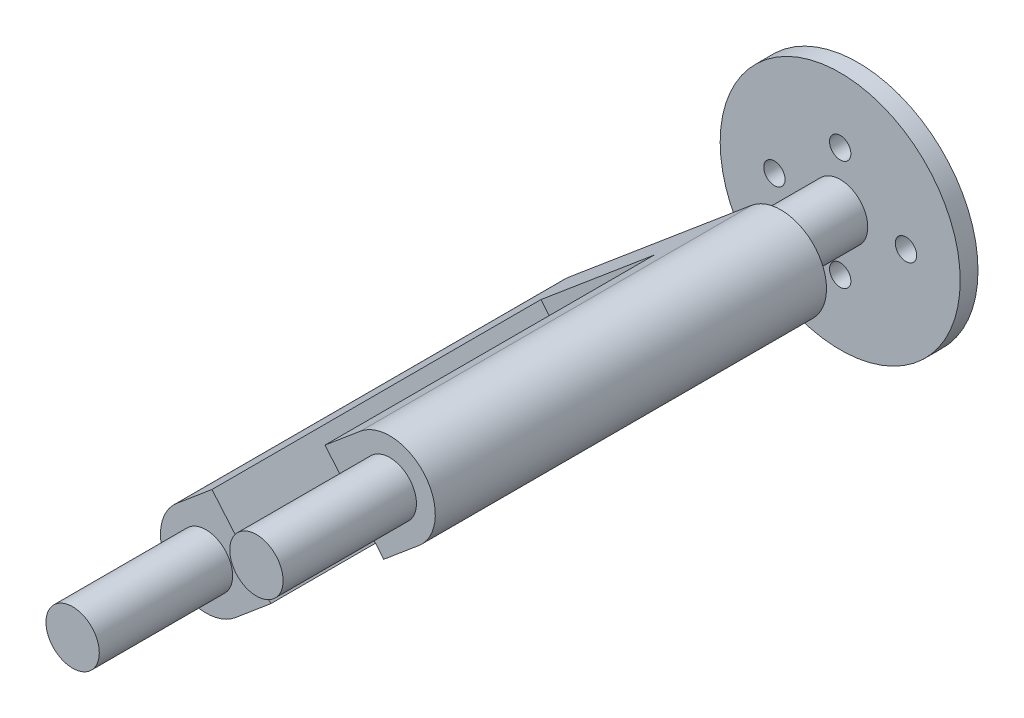
ISO-10303-21;
HEADER;
FILE_DESCRIPTION(('STEP AP214'),'2;1');
FILE_NAME('part.step','',(''),(''),'','','');
FILE_SCHEMA(('AUTOMOTIVE_DESIGN { 1 0 10303 214 1 1 1 1 }'));
ENDSEC;
DATA;
#1=APPLICATION_CONTEXT('core data for automotive mechanical design processes');
#2=APPLICATION_PROTOCOL_DEFINITION('international standard','automotive_design',2000,#1);
#3=PRODUCT_CONTEXT('',#1,'mechanical');
#4=PRODUCT('Part','Part','',(#3));
#5=PRODUCT_RELATED_PRODUCT_CATEGORY('part','',(#4));
#6=PRODUCT_DEFINITION_FORMATION('','',#4);
#7=PRODUCT_DEFINITION_CONTEXT('part definition',#1,'design');
#8=PRODUCT_DEFINITION('design','',#6,#7);
#9=PRODUCT_DEFINITION_SHAPE('','',#8);
#10=(LENGTH_UNIT() NAMED_UNIT(*) SI_UNIT(.MILLI.,.METRE.));
#11=(NAMED_UNIT(*) PLANE_ANGLE_UNIT() SI_UNIT($,.RADIAN.));
#12=(NAMED_UNIT(*) SI_UNIT($,.STERADIAN.) SOLID_ANGLE_UNIT());
#13=UNCERTAINTY_MEASURE_WITH_UNIT(LENGTH_MEASURE(1.E-05),#10,'distance_accuracy_value','');
#14=(GEOMETRIC_REPRESENTATION_CONTEXT(3) GLOBAL_UNCERTAINTY_ASSIGNED_CONTEXT((#13)) GLOBAL_UNIT_ASSIGNED_CONTEXT((#10,
#11,#12)) REPRESENTATION_CONTEXT('',''));
#15=CARTESIAN_POINT('',(0.,0.,0.));
#16=DIRECTION('',(0.,0.,1.));
#17=DIRECTION('',(1.,0.,0.));
#18=AXIS2_PLACEMENT_3D('',#15,#16,#17);
#19=CARTESIAN_POINT('',(13.1266768569368,11.0291150911376,80.01));
#20=DIRECTION('',(0.,0.,1.));
#21=DIRECTION('',(1.,0.,0.));
#22=AXIS2_PLACEMENT_3D('',#19,#20,#21);
#23=PLANE('',#22);
#24=DIRECTION('',(-0.645630982646055,0.763649549366389,0.));
#25=VECTOR('',#24,1.);
#26=CARTESIAN_POINT('',(8.08359687434195,6.76542019676247,80.01));
#27=LINE('',#26,#25);
#28=CARTESIAN_POINT('',(12.2694152674727,1.81445220488687,80.01));
#29=VERTEX_POINT('',#28);
#30=CARTESIAN_POINT('',(3.87161152714887,11.747338349357,80.01));
#31=VERTEX_POINT('',#30);
#32=EDGE_CURVE('E110',#29,#31,#27,.T.);
#33=ORIENTED_EDGE('',*,*,#32,.F.);
#34=DIRECTION('',(0.765627113265488,0.643284636403478,0.));
#35=VECTOR('',#34,1.);
#36=CARTESIAN_POINT('',(17.3102994193315,6.04983425000535,80.01));
#37=LINE('',#36,#35);
#38=CARTESIAN_POINT('',(17.3102994193315,6.04983425000535,80.01));
#39=VERTEX_POINT('',#38);
#40=EDGE_CURVE('E128',#29,#39,#37,.T.);
#41=ORIENTED_EDGE('',*,*,#40,.T.);
#42=CARTESIAN_POINT('',(13.1266768569368,11.0291150911376,80.01));
#43=DIRECTION('',(0.,0.,1.));
#44=DIRECTION('',(1.,0.,0.));
#45=AXIS2_PLACEMENT_3D('',#42,#43,#44);
#46=CIRCLE('',#45,6.5035325354337);
#47=CARTESIAN_POINT('',(8.94305429454215,16.0083959322699,80.01));
#48=VERTEX_POINT('',#47);
#49=EDGE_CURVE('E419',#39,#48,#46,.T.);
#50=ORIENTED_EDGE('',*,*,#49,.T.);
#51=DIRECTION('',(-0.765627113265488,-0.643284636403478,0.));
#52=VECTOR('',#51,1.);
#53=CARTESIAN_POINT('',(8.94305429454215,16.0083959322699,80.01));
#54=LINE('',#53,#52);
#55=EDGE_CURVE('E429',#48,#31,#54,.T.);
#56=ORIENTED_EDGE('',*,*,#55,.T.);
#57=EDGE_LOOP('',(#33,#41,#50,#56));
#58=FACE_BOUND('',#57,.T.);
#59=CARTESIAN_POINT('',(13.1266768569368,11.0291150911376,80.01));
#60=DIRECTION('',(0.,0.,1.));
#61=DIRECTION('',(1.,0.,0.));
#62=AXIS2_PLACEMENT_3D('',#59,#60,#61);
#63=CIRCLE('',#62,3.81);
#64=CARTESIAN_POINT('',(16.9366768569368,11.0291150911376,80.01));
#65=VERTEX_POINT('',#64);
#66=EDGE_CURVE('E111',#65,#65,#63,.T.);
#67=ORIENTED_EDGE('',*,*,#66,.F.);
#68=EDGE_LOOP('',(#67));
#69=FACE_BOUND('',#68,.T.);
#70=ADVANCED_FACE('F37',(#58,#69),#23,.T.);
#71=CARTESIAN_POINT('',(0.,0.,0.));
#72=DIRECTION('',(0.,0.,1.));
#73=DIRECTION('',(1.,0.,0.));
#74=AXIS2_PLACEMENT_3D('',#71,#72,#73);
#75=CYLINDRICAL_SURFACE('',#74,3.937);
#76=CARTESIAN_POINT('',(0.,0.,21.59));
#77=DIRECTION('',(0.,0.,1.));
#78=DIRECTION('',(1.,0.,0.));
#79=AXIS2_PLACEMENT_3D('',#76,#77,#78);
#80=CIRCLE('',#79,3.937);
#81=CARTESIAN_POINT('',(3.937,0.,21.59));
#82=VERTEX_POINT('',#81);
#83=EDGE_CURVE('E45',#82,#82,#80,.F.);
#84=ORIENTED_EDGE('',*,*,#83,.T.);
#85=EDGE_LOOP('',(#84));
#86=FACE_BOUND('',#85,.T.);
#87=CARTESIAN_POINT('',(0.,0.,2.54));
#88=DIRECTION('',(0.,0.,1.));
#89=DIRECTION('',(1.,0.,0.));
#90=AXIS2_PLACEMENT_3D('',#87,#88,#89);
#91=CIRCLE('',#90,3.937);
#92=CARTESIAN_POINT('',(3.937,0.,2.54));
#93=VERTEX_POINT('',#92);
#94=EDGE_CURVE('E173',#93,#93,#91,.T.);
#95=ORIENTED_EDGE('',*,*,#94,.T.);
#96=EDGE_LOOP('',(#95));
#97=FACE_BOUND('',#96,.T.);
#98=ADVANCED_FACE('F191',(#86,#97),#75,.T.);
#99=CARTESIAN_POINT('',(0.,0.,2.54));
#100=DIRECTION('',(0.,0.,1.));
#101=DIRECTION('',(1.,0.,0.));
#102=AXIS2_PLACEMENT_3D('',#99,#100,#101);
#103=PLANE('',#102);
#104=CARTESIAN_POINT('',(-3.06917882681312E-13,-7.87400000000045,2.54));
#105=DIRECTION('',(0.,0.,1.));
#106=DIRECTION('',(1.,0.,0.));
#107=AXIS2_PLACEMENT_3D('',#104,#105,#106);
#108=CIRCLE('',#107,1.52399999999963);
#109=CARTESIAN_POINT('',(1.52399999999932,-7.87400000000045,2.54));
#110=VERTEX_POINT('',#109);
#111=EDGE_CURVE('E158',#110,#110,#108,.T.);
#112=ORIENTED_EDGE('',*,*,#111,.F.);
#113=EDGE_LOOP('',(#112));
#114=FACE_BOUND('',#113,.T.);
#115=CARTESIAN_POINT('',(0.,7.874,2.54));
#116=DIRECTION('',(0.,0.,1.));
#117=DIRECTION('',(1.,0.,0.));
#118=AXIS2_PLACEMENT_3D('',#115,#116,#117);
#119=CIRCLE('',#118,1.524);
#120=CARTESIAN_POINT('',(1.524,7.874,2.54));
#121=VERTEX_POINT('',#120);
#122=EDGE_CURVE('E170',#121,#121,#119,.T.);
#123=ORIENTED_EDGE('',*,*,#122,.F.);
#124=EDGE_LOOP('',(#123));
#125=FACE_BOUND('',#124,.T.);
#126=CARTESIAN_POINT('',(0.,0.,2.54));
#127=DIRECTION('',(0.,0.,1.));
#128=DIRECTION('',(1.,0.,0.));
#129=AXIS2_PLACEMENT_3D('',#126,#127,#128);
#130=CIRCLE('',#129,17.145);
#131=CARTESIAN_POINT('',(17.145,0.,2.54));
#132=VERTEX_POINT('',#131);
#133=EDGE_CURVE('E179',#132,#132,#130,.T.);
#134=ORIENTED_EDGE('',*,*,#133,.T.);
#135=EDGE_LOOP('',(#134));
#136=FACE_BOUND('',#135,.T.);
#137=ORIENTED_EDGE('',*,*,#94,.F.);
#138=EDGE_LOOP('',(#137));
#139=FACE_BOUND('',#138,.T.);
#140=CARTESIAN_POINT('',(-9.398,0.,2.54));
#141=DIRECTION('',(0.,0.,1.));
#142=DIRECTION('',(1.,0.,0.));
#143=AXIS2_PLACEMENT_3D('',#140,#141,#142);
#144=CIRCLE('',#143,1.524);
#145=CARTESIAN_POINT('',(-7.874,0.,2.54));
#146=VERTEX_POINT('',#145);
#147=EDGE_CURVE('E164',#146,#146,#144,.T.);
#148=ORIENTED_EDGE('',*,*,#147,.F.);
#149=EDGE_LOOP('',(#148));
#150=FACE_BOUND('',#149,.T.);
#151=CARTESIAN_POINT('',(9.398,0.,2.54));
#152=DIRECTION('',(0.,0.,1.));
#153=DIRECTION('',(1.,0.,0.));
#154=AXIS2_PLACEMENT_3D('',#151,#152,#153);
#155=CIRCLE('',#154,1.524);
#156=CARTESIAN_POINT('',(10.922,0.,2.54));
#157=VERTEX_POINT('',#156);
#158=EDGE_CURVE('E152',#157,#157,#155,.T.);
#159=ORIENTED_EDGE('',*,*,#158,.F.);
#160=EDGE_LOOP('',(#159));
#161=FACE_BOUND('',#160,.T.);
#162=ADVANCED_FACE('F209',(#114,#125,#136,#139,#150,#161),#103,.T.);
#163=CARTESIAN_POINT('',(0.,0.,0.));
#164=DIRECTION('',(0.,0.,1.));
#165=DIRECTION('',(1.,0.,0.));
#166=AXIS2_PLACEMENT_3D('',#163,#164,#165);
#167=PLANE('',#166);
#168=CARTESIAN_POINT('',(0.,0.,0.));
#169=DIRECTION('',(0.,0.,1.));
#170=DIRECTION('',(1.,0.,0.));
#171=AXIS2_PLACEMENT_3D('',#168,#169,#170);
#172=CIRCLE('',#171,17.145);
#173=CARTESIAN_POINT('',(17.145,0.,0.));
#174=VERTEX_POINT('',#173);
#175=EDGE_CURVE('E178',#174,#174,#172,.T.);
#176=ORIENTED_EDGE('',*,*,#175,.F.);
#177=EDGE_LOOP('',(#176));
#178=FACE_BOUND('',#177,.T.);
#179=CARTESIAN_POINT('',(0.,7.874,0.));
#180=DIRECTION('',(0.,0.,1.));
#181=DIRECTION('',(1.,0.,0.));
#182=AXIS2_PLACEMENT_3D('',#179,#180,#181);
#183=CIRCLE('',#182,1.524);
#184=CARTESIAN_POINT('',(1.524,7.874,0.));
#185=VERTEX_POINT('',#184);
#186=EDGE_CURVE('E167',#185,#185,#183,.T.);
#187=ORIENTED_EDGE('',*,*,#186,.T.);
#188=EDGE_LOOP('',(#187));
#189=FACE_BOUND('',#188,.T.);
#190=CARTESIAN_POINT('',(-9.398,0.,0.));
#191=DIRECTION('',(0.,0.,1.));
#192=DIRECTION('',(1.,0.,0.));
#193=AXIS2_PLACEMENT_3D('',#190,#191,#192);
#194=CIRCLE('',#193,1.524);
#195=CARTESIAN_POINT('',(-7.874,0.,0.));
#196=VERTEX_POINT('',#195);
#197=EDGE_CURVE('E161',#196,#196,#194,.T.);
#198=ORIENTED_EDGE('',*,*,#197,.T.);
#199=EDGE_LOOP('',(#198));
#200=FACE_BOUND('',#199,.T.);
#201=CARTESIAN_POINT('',(-3.06917882681312E-13,-7.87400000000045,0.));
#202=DIRECTION('',(0.,0.,1.));
#203=DIRECTION('',(1.,0.,0.));
#204=AXIS2_PLACEMENT_3D('',#201,#202,#203);
#205=CIRCLE('',#204,1.52399999999963);
#206=CARTESIAN_POINT('',(1.52399999999932,-7.87400000000045,0.));
#207=VERTEX_POINT('',#206);
#208=EDGE_CURVE('E155',#207,#207,#205,.T.);
#209=ORIENTED_EDGE('',*,*,#208,.T.);
#210=EDGE_LOOP('',(#209));
#211=FACE_BOUND('',#210,.T.);
#212=CARTESIAN_POINT('',(9.398,0.,0.));
#213=DIRECTION('',(0.,0.,1.));
#214=DIRECTION('',(1.,0.,0.));
#215=AXIS2_PLACEMENT_3D('',#212,#213,#214);
#216=CIRCLE('',#215,1.524);
#217=CARTESIAN_POINT('',(10.922,0.,0.));
#218=VERTEX_POINT('',#217);
#219=EDGE_CURVE('E145',#218,#218,#216,.T.);
#220=ORIENTED_EDGE('',*,*,#219,.T.);
#221=EDGE_LOOP('',(#220));
#222=FACE_BOUND('',#221,.T.);
#223=ADVANCED_FACE('F261',(#178,#189,#200,#211,#222),#167,.F.);
#224=CARTESIAN_POINT('',(0.,0.,2.54));
#225=DIRECTION('',(0.,0.,-1.));
#226=DIRECTION('',(-1.,0.,0.));
#227=AXIS2_PLACEMENT_3D('',#224,#225,#226);
#228=CYLINDRICAL_SURFACE('',#227,17.145);
#229=ORIENTED_EDGE('',*,*,#133,.F.);
#230=EDGE_LOOP('',(#229));
#231=FACE_BOUND('',#230,.T.);
#232=ORIENTED_EDGE('',*,*,#175,.T.);
#233=EDGE_LOOP('',(#232));
#234=FACE_BOUND('',#233,.T.);
#235=ADVANCED_FACE('F257',(#231,#234),#228,.T.);
#236=CARTESIAN_POINT('',(0.,7.874,2.54));
#237=DIRECTION('',(0.,0.,-1.));
#238=DIRECTION('',(-1.,0.,0.));
#239=AXIS2_PLACEMENT_3D('',#236,#237,#238);
#240=CYLINDRICAL_SURFACE('',#239,1.524);
#241=ORIENTED_EDGE('',*,*,#122,.T.);
#242=EDGE_LOOP('',(#241));
#243=FACE_BOUND('',#242,.T.);
#244=ORIENTED_EDGE('',*,*,#186,.F.);
#245=EDGE_LOOP('',(#244));
#246=FACE_BOUND('',#245,.T.);
#247=ADVANCED_FACE('F253',(#243,#246),#240,.F.);
#248=CARTESIAN_POINT('',(-9.398,0.,2.54));
#249=DIRECTION('',(0.,0.,-1.));
#250=DIRECTION('',(-1.,0.,0.));
#251=AXIS2_PLACEMENT_3D('',#248,#249,#250);
#252=CYLINDRICAL_SURFACE('',#251,1.524);
#253=ORIENTED_EDGE('',*,*,#147,.T.);
#254=EDGE_LOOP('',(#253));
#255=FACE_BOUND('',#254,.T.);
#256=ORIENTED_EDGE('',*,*,#197,.F.);
#257=EDGE_LOOP('',(#256));
#258=FACE_BOUND('',#257,.T.);
#259=ADVANCED_FACE('F249',(#255,#258),#252,.F.);
#260=CARTESIAN_POINT('',(-3.06917882681312E-13,-7.87400000000045,2.54));
#261=DIRECTION('',(0.,0.,-1.));
#262=DIRECTION('',(-1.,0.,0.));
#263=AXIS2_PLACEMENT_3D('',#260,#261,#262);
#264=CYLINDRICAL_SURFACE('',#263,1.52399999999963);
#265=ORIENTED_EDGE('',*,*,#111,.T.);
#266=EDGE_LOOP('',(#265));
#267=FACE_BOUND('',#266,.T.);
#268=ORIENTED_EDGE('',*,*,#208,.F.);
#269=EDGE_LOOP('',(#268));
#270=FACE_BOUND('',#269,.T.);
#271=ADVANCED_FACE('F245',(#267,#270),#264,.F.);
#272=CARTESIAN_POINT('',(9.398,0.,2.54));
#273=DIRECTION('',(0.,0.,-1.));
#274=DIRECTION('',(-1.,0.,0.));
#275=AXIS2_PLACEMENT_3D('',#272,#273,#274);
#276=CYLINDRICAL_SURFACE('',#275,1.524);
#277=ORIENTED_EDGE('',*,*,#158,.T.);
#278=EDGE_LOOP('',(#277));
#279=FACE_BOUND('',#278,.T.);
#280=ORIENTED_EDGE('',*,*,#219,.F.);
#281=EDGE_LOOP('',(#280));
#282=FACE_BOUND('',#281,.T.);
#283=ADVANCED_FACE('F241',(#279,#282),#276,.F.);
#284=CARTESIAN_POINT('',(13.1266768569368,11.0291150911376,24.13));
#285=DIRECTION('',(0.,0.,1.));
#286=DIRECTION('',(1.,0.,0.));
#287=AXIS2_PLACEMENT_3D('',#284,#285,#286);
#288=CYLINDRICAL_SURFACE('',#287,6.5035325354337);
#289=DIRECTION('',(0.,0.,1.));
#290=VECTOR('',#289,1.);
#291=CARTESIAN_POINT('',(8.94305429454215,16.0083959322699,24.13));
#292=LINE('',#291,#290);
#293=CARTESIAN_POINT('',(8.94305429454215,16.0083959322699,24.13));
#294=VERTEX_POINT('',#293);
#295=EDGE_CURVE('E143',#294,#48,#292,.T.);
#296=ORIENTED_EDGE('',*,*,#295,.T.);
#297=ORIENTED_EDGE('',*,*,#49,.F.);
#298=DIRECTION('',(0.,0.,1.));
#299=VECTOR('',#298,1.);
#300=CARTESIAN_POINT('',(17.3102994193315,6.04983425000535,24.13));
#301=LINE('',#300,#299);
#302=CARTESIAN_POINT('',(17.3102994193315,6.04983425000535,24.13));
#303=VERTEX_POINT('',#302);
#304=EDGE_CURVE('E60',#303,#39,#301,.T.);
#305=ORIENTED_EDGE('',*,*,#304,.F.);
#306=CARTESIAN_POINT('',(13.1266768569368,11.0291150911376,24.13));
#307=DIRECTION('',(0.,0.,1.));
#308=DIRECTION('',(1.,0.,0.));
#309=AXIS2_PLACEMENT_3D('',#306,#307,#308);
#310=CIRCLE('',#309,6.5035325354337);
#311=EDGE_CURVE('E127',#303,#294,#310,.T.);
#312=ORIENTED_EDGE('',*,*,#311,.T.);
#313=EDGE_LOOP('',(#296,#297,#305,#312));
#314=FACE_BOUND('',#313,.T.);
#315=ADVANCED_FACE('F236',(#314),#288,.T.);
#316=CARTESIAN_POINT('',(17.3102994193315,6.04983425000535,24.13));
#317=DIRECTION('',(0.643284636403478,-0.765627113265489,0.));
#318=DIRECTION('',(0.765627113265489,0.643284636403478,0.));
#319=AXIS2_PLACEMENT_3D('',#316,#317,#318);
#320=PLANE('',#319);
#321=DIRECTION('',(0.,0.,1.));
#322=VECTOR('',#321,1.);
#323=CARTESIAN_POINT('',(12.2694152674727,1.81445220488687,24.13));
#324=LINE('',#323,#322);
#325=CARTESIAN_POINT('',(12.2694152674727,1.81445220488687,33.02));
#326=VERTEX_POINT('',#325);
#327=EDGE_CURVE('E438',#326,#29,#324,.T.);
#328=ORIENTED_EDGE('',*,*,#327,.F.);
#329=DIRECTION('',(0.765627113265489,0.643284636403478,0.));
#330=VECTOR('',#329,1.);
#331=CARTESIAN_POINT('',(17.3102994193315,6.04983425000535,33.02));
#332=LINE('',#331,#330);
#333=CARTESIAN_POINT('',(-3.87161152714887,-11.747338349357,33.02));
#334=VERTEX_POINT('',#333);
#335=EDGE_CURVE('E119',#334,#326,#332,.T.);
#336=ORIENTED_EDGE('',*,*,#335,.F.);
#337=DIRECTION('',(0.,0.,-1.));
#338=VECTOR('',#337,1.);
#339=CARTESIAN_POINT('',(-3.87161152714887,-11.747338349357,24.13));
#340=LINE('',#339,#338);
#341=CARTESIAN_POINT('',(-3.87161152714887,-11.747338349357,80.01));
#342=VERTEX_POINT('',#341);
#343=EDGE_CURVE('E105',#342,#334,#340,.T.);
#344=ORIENTED_EDGE('',*,*,#343,.F.);
#345=CARTESIAN_POINT('',(-8.94305429454215,-16.0083959322699,80.01));
#346=VERTEX_POINT('',#345);
#347=EDGE_CURVE('E118',#346,#342,#37,.T.);
#348=ORIENTED_EDGE('',*,*,#347,.F.);
#349=DIRECTION('',(0.,0.,1.));
#350=VECTOR('',#349,1.);
#351=CARTESIAN_POINT('',(-8.94305429454215,-16.0083959322699,24.13));
#352=LINE('',#351,#350);
#353=CARTESIAN_POINT('',(-8.94305429454215,-16.0083959322699,24.13));
#354=VERTEX_POINT('',#353);
#355=EDGE_CURVE('E146',#354,#346,#352,.T.);
#356=ORIENTED_EDGE('',*,*,#355,.F.);
#357=DIRECTION('',(0.765627113265488,0.643284636403478,0.));
#358=VECTOR('',#357,1.);
#359=CARTESIAN_POINT('',(17.3102994193315,6.04983425000535,24.13));
#360=LINE('',#359,#358);
#361=EDGE_CURVE('E140',#354,#303,#360,.T.);
#362=ORIENTED_EDGE('',*,*,#361,.T.);
#363=ORIENTED_EDGE('',*,*,#304,.T.);
#364=ORIENTED_EDGE('',*,*,#40,.F.);
#365=EDGE_LOOP('',(#328,#336,#344,#348,#356,#362,#363,#364));
#366=FACE_BOUND('',#365,.T.);
#367=ADVANCED_FACE('F117',(#366),#320,.T.);
#368=CARTESIAN_POINT('',(-13.1266768569368,-11.0291150911376,24.13));
#369=DIRECTION('',(0.,0.,1.));
#370=DIRECTION('',(1.,0.,0.));
#371=AXIS2_PLACEMENT_3D('',#368,#369,#370);
#372=CYLINDRICAL_SURFACE('',#371,6.5035325354337);
#373=ORIENTED_EDGE('',*,*,#355,.T.);
#374=CARTESIAN_POINT('',(-13.1266768569368,-11.0291150911376,80.01));
#375=DIRECTION('',(0.,0.,1.));
#376=DIRECTION('',(1.,0.,0.));
#377=AXIS2_PLACEMENT_3D('',#374,#375,#376);
#378=CIRCLE('',#377,6.5035325354337);
#379=CARTESIAN_POINT('',(-17.3102994193315,-6.04983425000535,80.01));
#380=VERTEX_POINT('',#379);
#381=EDGE_CURVE('E126',#380,#346,#378,.T.);
#382=ORIENTED_EDGE('',*,*,#381,.F.);
#383=DIRECTION('',(0.,0.,1.));
#384=VECTOR('',#383,1.);
#385=CARTESIAN_POINT('',(-17.3102994193315,-6.04983425000535,24.13));
#386=LINE('',#385,#384);
#387=CARTESIAN_POINT('',(-17.3102994193315,-6.04983425000535,24.13));
#388=VERTEX_POINT('',#387);
#389=EDGE_CURVE('E148',#388,#380,#386,.T.);
#390=ORIENTED_EDGE('',*,*,#389,.F.);
#391=CARTESIAN_POINT('',(-13.1266768569368,-11.0291150911376,24.13));
#392=DIRECTION('',(0.,0.,1.));
#393=DIRECTION('',(1.,0.,0.));
#394=AXIS2_PLACEMENT_3D('',#391,#392,#393);
#395=CIRCLE('',#394,6.5035325354337);
#396=EDGE_CURVE('E137',#388,#354,#395,.T.);
#397=ORIENTED_EDGE('',*,*,#396,.T.);
#398=EDGE_LOOP('',(#373,#382,#390,#397));
#399=FACE_BOUND('',#398,.T.);
#400=ADVANCED_FACE('F229',(#399),#372,.T.);
#401=CARTESIAN_POINT('',(8.94305429454215,16.0083959322699,24.13));
#402=DIRECTION('',(-0.643284636403478,0.765627113265489,0.));
#403=DIRECTION('',(-0.765627113265489,-0.643284636403478,0.));
#404=AXIS2_PLACEMENT_3D('',#401,#402,#403);
#405=PLANE('',#404);
#406=DIRECTION('',(0.,0.,-1.));
#407=VECTOR('',#406,1.);
#408=CARTESIAN_POINT('',(3.87161152714887,11.747338349357,24.13));
#409=LINE('',#408,#407);
#410=CARTESIAN_POINT('',(3.87161152714887,11.747338349357,33.02));
#411=VERTEX_POINT('',#410);
#412=EDGE_CURVE('E120',#31,#411,#409,.T.);
#413=ORIENTED_EDGE('',*,*,#412,.F.);
#414=ORIENTED_EDGE('',*,*,#55,.F.);
#415=ORIENTED_EDGE('',*,*,#295,.F.);
#416=DIRECTION('',(-0.765627113265488,-0.643284636403478,0.));
#417=VECTOR('',#416,1.);
#418=CARTESIAN_POINT('',(8.94305429454215,16.0083959322699,24.13));
#419=LINE('',#418,#417);
#420=EDGE_CURVE('E130',#294,#388,#419,.T.);
#421=ORIENTED_EDGE('',*,*,#420,.T.);
#422=ORIENTED_EDGE('',*,*,#389,.T.);
#423=CARTESIAN_POINT('',(-12.2694152674727,-1.81445220488686,80.01));
#424=VERTEX_POINT('',#423);
#425=EDGE_CURVE('E423',#424,#380,#54,.T.);
#426=ORIENTED_EDGE('',*,*,#425,.F.);
#427=DIRECTION('',(0.,0.,1.));
#428=VECTOR('',#427,1.);
#429=CARTESIAN_POINT('',(-12.2694152674727,-1.81445220488687,24.13));
#430=LINE('',#429,#428);
#431=CARTESIAN_POINT('',(-12.2694152674727,-1.81445220488687,33.02));
#432=VERTEX_POINT('',#431);
#433=EDGE_CURVE('E52',#432,#424,#430,.T.);
#434=ORIENTED_EDGE('',*,*,#433,.F.);
#435=DIRECTION('',(-0.765627113265489,-0.643284636403478,0.));
#436=VECTOR('',#435,1.);
#437=CARTESIAN_POINT('',(8.94305429454215,16.0083959322699,33.02));
#438=LINE('',#437,#436);
#439=EDGE_CURVE('E187',#411,#432,#438,.T.);
#440=ORIENTED_EDGE('',*,*,#439,.F.);
#441=EDGE_LOOP('',(#413,#414,#415,#421,#422,#426,#434,#440));
#442=FACE_BOUND('',#441,.T.);
#443=ADVANCED_FACE('F224',(#442),#405,.T.);
#444=CARTESIAN_POINT('',(13.1266768569368,11.0291150911376,24.13));
#445=DIRECTION('',(0.,0.,1.));
#446=DIRECTION('',(1.,0.,0.));
#447=AXIS2_PLACEMENT_3D('',#444,#445,#446);
#448=PLANE('',#447);
#449=CARTESIAN_POINT('',(0.,0.,24.13));
#450=DIRECTION('',(0.,0.,1.));
#451=DIRECTION('',(1.,0.,0.));
#452=AXIS2_PLACEMENT_3D('',#449,#450,#451);
#453=CIRCLE('',#452,6.477);
#454=CARTESIAN_POINT('',(6.477,0.,24.13));
#455=VERTEX_POINT('',#454);
#456=EDGE_CURVE('E11',#455,#455,#453,.T.);
#457=ORIENTED_EDGE('',*,*,#456,.T.);
#458=EDGE_LOOP('',(#457));
#459=FACE_BOUND('',#458,.T.);
#460=ORIENTED_EDGE('',*,*,#311,.F.);
#461=ORIENTED_EDGE('',*,*,#361,.F.);
#462=ORIENTED_EDGE('',*,*,#396,.F.);
#463=ORIENTED_EDGE('',*,*,#420,.F.);
#464=EDGE_LOOP('',(#460,#461,#462,#463));
#465=FACE_BOUND('',#464,.T.);
#466=ADVANCED_FACE('F217',(#459,#465),#448,.F.);
#467=DIRECTION('',(0.645630982646055,-0.763649549366389,0.));
#468=VECTOR('',#467,1.);
#469=CARTESIAN_POINT('',(-8.01566292540026,-6.84577217938166,80.01));
#470=LINE('',#469,#468);
#471=EDGE_CURVE('E102',#424,#342,#470,.T.);
#472=ORIENTED_EDGE('',*,*,#471,.F.);
#473=ORIENTED_EDGE('',*,*,#425,.T.);
#474=ORIENTED_EDGE('',*,*,#381,.T.);
#475=ORIENTED_EDGE('',*,*,#347,.T.);
#476=EDGE_LOOP('',(#472,#473,#474,#475));
#477=FACE_BOUND('',#476,.T.);
#478=CARTESIAN_POINT('',(-13.1266768569368,-11.0291150911376,80.01));
#479=DIRECTION('',(0.,0.,1.));
#480=DIRECTION('',(1.,0.,0.));
#481=AXIS2_PLACEMENT_3D('',#478,#479,#480);
#482=CIRCLE('',#481,3.81);
#483=CARTESIAN_POINT('',(-9.3166768569368,-11.0291150911376,80.01));
#484=VERTEX_POINT('',#483);
#485=EDGE_CURVE('E426',#484,#484,#482,.T.);
#486=ORIENTED_EDGE('',*,*,#485,.F.);
#487=EDGE_LOOP('',(#486));
#488=FACE_BOUND('',#487,.T.);
#489=ADVANCED_FACE('F123',(#477,#488),#23,.T.);
#490=CARTESIAN_POINT('',(13.1266768569368,11.0291150911376,99.06));
#491=DIRECTION('',(0.,0.,-1.));
#492=DIRECTION('',(-1.,0.,0.));
#493=AXIS2_PLACEMENT_3D('',#490,#491,#492);
#494=CYLINDRICAL_SURFACE('',#493,3.81);
#495=CARTESIAN_POINT('',(13.1266768569368,11.0291150911376,99.06));
#496=DIRECTION('',(0.,0.,1.));
#497=DIRECTION('',(1.,0.,0.));
#498=AXIS2_PLACEMENT_3D('',#495,#496,#497);
#499=CIRCLE('',#498,3.81);
#500=CARTESIAN_POINT('',(16.9366768569368,11.0291150911376,99.06));
#501=VERTEX_POINT('',#500);
#502=EDGE_CURVE('E418',#501,#501,#499,.F.);
#503=ORIENTED_EDGE('',*,*,#502,.T.);
#504=EDGE_LOOP('',(#503));
#505=FACE_BOUND('',#504,.T.);
#506=ORIENTED_EDGE('',*,*,#66,.T.);
#507=EDGE_LOOP('',(#506));
#508=FACE_BOUND('',#507,.T.);
#509=ADVANCED_FACE('F216',(#505,#508),#494,.T.);
#510=CARTESIAN_POINT('',(0.,0.,99.06));
#511=DIRECTION('',(0.,0.,1.));
#512=DIRECTION('',(1.,0.,0.));
#513=AXIS2_PLACEMENT_3D('',#510,#511,#512);
#514=PLANE('',#513);
#515=ORIENTED_EDGE('',*,*,#502,.F.);
#516=EDGE_LOOP('',(#515));
#517=FACE_BOUND('',#516,.T.);
#518=ADVANCED_FACE('F222',(#517),#514,.T.);
#519=CARTESIAN_POINT('',(-13.1266768569368,-11.0291150911376,99.06));
#520=DIRECTION('',(0.,0.,-1.));
#521=DIRECTION('',(-1.,0.,0.));
#522=AXIS2_PLACEMENT_3D('',#519,#520,#521);
#523=CYLINDRICAL_SURFACE('',#522,3.81);
#524=CARTESIAN_POINT('',(-13.1266768569368,-11.0291150911376,99.06));
#525=DIRECTION('',(0.,0.,1.));
#526=DIRECTION('',(1.,0.,0.));
#527=AXIS2_PLACEMENT_3D('',#524,#525,#526);
#528=CIRCLE('',#527,3.81);
#529=CARTESIAN_POINT('',(-9.3166768569368,-11.0291150911376,99.06));
#530=VERTEX_POINT('',#529);
#531=EDGE_CURVE('E420',#530,#530,#528,.T.);
#532=ORIENTED_EDGE('',*,*,#531,.F.);
#533=EDGE_LOOP('',(#532));
#534=FACE_BOUND('',#533,.T.);
#535=ORIENTED_EDGE('',*,*,#485,.T.);
#536=EDGE_LOOP('',(#535));
#537=FACE_BOUND('',#536,.T.);
#538=ADVANCED_FACE('F407',(#534,#537),#523,.T.);
#539=CARTESIAN_POINT('',(0.,0.,99.06));
#540=DIRECTION('',(0.,0.,1.));
#541=DIRECTION('',(1.,0.,0.));
#542=AXIS2_PLACEMENT_3D('',#539,#540,#541);
#543=PLANE('',#542);
#544=ORIENTED_EDGE('',*,*,#531,.T.);
#545=EDGE_LOOP('',(#544));
#546=FACE_BOUND('',#545,.T.);
#547=ADVANCED_FACE('F343',(#546),#543,.T.);
#548=CARTESIAN_POINT('',(3.3740417484959,12.3358617434627,33.02));
#549=DIRECTION('',(0.763649549366389,0.645630982646055,0.));
#550=DIRECTION('',(-0.645630982646055,0.763649549366389,0.));
#551=AXIS2_PLACEMENT_3D('',#548,#549,#550);
#552=PLANE('',#551);
#553=ORIENTED_EDGE('',*,*,#327,.T.);
#554=ORIENTED_EDGE('',*,*,#32,.T.);
#555=ORIENTED_EDGE('',*,*,#412,.T.);
#556=DIRECTION('',(-0.645630982646055,0.763649549366389,0.));
#557=VECTOR('',#556,1.);
#558=CARTESIAN_POINT('',(3.3740417484959,12.3358617434627,33.02));
#559=LINE('',#558,#557);
#560=EDGE_CURVE('E447',#326,#411,#559,.T.);
#561=ORIENTED_EDGE('',*,*,#560,.F.);
#562=EDGE_LOOP('',(#553,#554,#555,#561));
#563=FACE_BOUND('',#562,.T.);
#564=ADVANCED_FACE('F338',(#563),#552,.F.);
#565=CARTESIAN_POINT('',(-12.7252180512463,-1.27533063268141,33.02));
#566=DIRECTION('',(-0.763649549366389,-0.645630982646055,0.));
#567=DIRECTION('',(0.645630982646055,-0.763649549366389,0.));
#568=AXIS2_PLACEMENT_3D('',#565,#566,#567);
#569=PLANE('',#568);
#570=ORIENTED_EDGE('',*,*,#343,.T.);
#571=DIRECTION('',(0.645630982646055,-0.763649549366389,0.));
#572=VECTOR('',#571,1.);
#573=CARTESIAN_POINT('',(-12.7252180512463,-1.27533063268141,33.02));
#574=LINE('',#573,#572);
#575=EDGE_CURVE('E445',#432,#334,#574,.T.);
#576=ORIENTED_EDGE('',*,*,#575,.F.);
#577=ORIENTED_EDGE('',*,*,#433,.T.);
#578=ORIENTED_EDGE('',*,*,#471,.T.);
#579=EDGE_LOOP('',(#570,#576,#577,#578));
#580=FACE_BOUND('',#579,.T.);
#581=ADVANCED_FACE('F104',(#580),#569,.F.);
#582=CARTESIAN_POINT('',(0.,0.,33.02));
#583=DIRECTION('',(0.,0.,-1.));
#584=DIRECTION('',(-1.,0.,0.));
#585=AXIS2_PLACEMENT_3D('',#582,#583,#584);
#586=PLANE('',#585);
#587=ORIENTED_EDGE('',*,*,#335,.T.);
#588=ORIENTED_EDGE('',*,*,#560,.T.);
#589=ORIENTED_EDGE('',*,*,#439,.T.);
#590=ORIENTED_EDGE('',*,*,#575,.T.);
#591=EDGE_LOOP('',(#587,#588,#589,#590));
#592=FACE_BOUND('',#591,.T.);
#593=ADVANCED_FACE('F195',(#592),#586,.F.);
#594=CARTESIAN_POINT('',(0.,0.,21.59));
#595=DIRECTION('',(0.,0.,1.));
#596=DIRECTION('',(1.,0.,0.));
#597=AXIS2_PLACEMENT_3D('',#594,#595,#596);
#598=TOROIDAL_SURFACE('',#597,6.477,2.54);
#599=ORIENTED_EDGE('',*,*,#456,.F.);
#600=EDGE_LOOP('',(#599));
#601=FACE_BOUND('',#600,.T.);
#602=ORIENTED_EDGE('',*,*,#83,.F.);
#603=EDGE_LOOP('',(#602));
#604=FACE_BOUND('',#603,.T.);
#605=ADVANCED_FACE('F39',(#601,#604),#598,.F.);
#606=CLOSED_SHELL('',(#70,#98,#162,#223,#235,#247,#259,#271,#283,#315,#367,#400,#443,#466,#489,
#509,#518,#538,#547,#564,#581,#593,#605));
#607=MANIFOLD_SOLID_BREP('B2',#606);
#608=ADVANCED_BREP_SHAPE_REPRESENTATION('',(#18,#607),#14);
#609=SHAPE_DEFINITION_REPRESENTATION(#9,#608);
ENDSEC;
END-ISO-10303-21;
